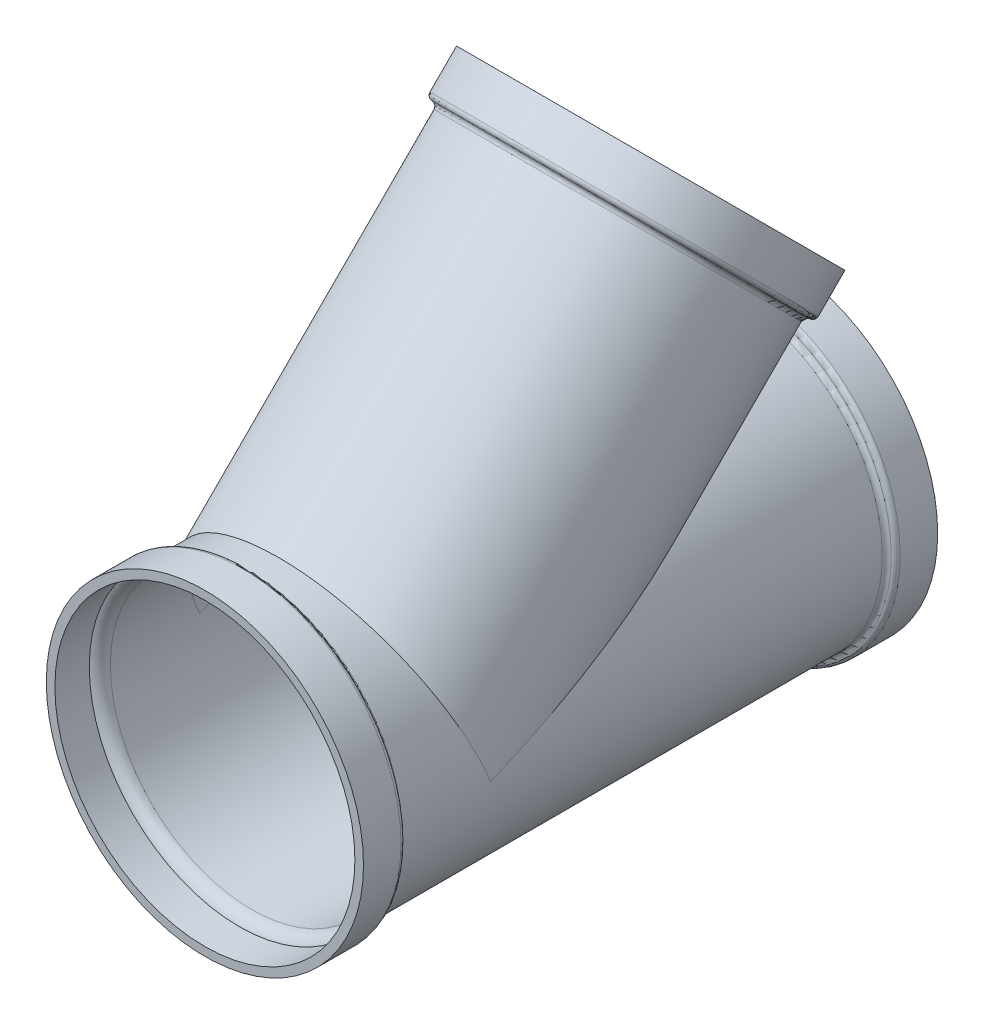
ISO-10303-21;
HEADER;
FILE_DESCRIPTION(('STEP AP214'),'2;1');
FILE_NAME('part.step','',(''),(''),'','','');
FILE_SCHEMA(('AUTOMOTIVE_DESIGN { 1 0 10303 214 1 1 1 1 }'));
ENDSEC;
DATA;
#1=APPLICATION_CONTEXT('core data for automotive mechanical design processes');
#2=APPLICATION_PROTOCOL_DEFINITION('international standard','automotive_design',2000,#1);
#3=PRODUCT_CONTEXT('',#1,'mechanical');
#4=PRODUCT('Part','Part','',(#3));
#5=PRODUCT_RELATED_PRODUCT_CATEGORY('part','',(#4));
#6=PRODUCT_DEFINITION_FORMATION('','',#4);
#7=PRODUCT_DEFINITION_CONTEXT('part definition',#1,'design');
#8=PRODUCT_DEFINITION('design','',#6,#7);
#9=PRODUCT_DEFINITION_SHAPE('','',#8);
#10=(LENGTH_UNIT() NAMED_UNIT(*) SI_UNIT(.MILLI.,.METRE.));
#11=(NAMED_UNIT(*) PLANE_ANGLE_UNIT() SI_UNIT($,.RADIAN.));
#12=(NAMED_UNIT(*) SI_UNIT($,.STERADIAN.) SOLID_ANGLE_UNIT());
#13=UNCERTAINTY_MEASURE_WITH_UNIT(LENGTH_MEASURE(1.E-05),#10,'distance_accuracy_value','');
#14=(GEOMETRIC_REPRESENTATION_CONTEXT(3) GLOBAL_UNCERTAINTY_ASSIGNED_CONTEXT((#13)) GLOBAL_UNIT_ASSIGNED_CONTEXT((#10,
#11,#12)) REPRESENTATION_CONTEXT('',''));
#15=CARTESIAN_POINT('',(0.,0.,0.));
#16=DIRECTION('',(0.,0.,1.));
#17=DIRECTION('',(1.,0.,0.));
#18=AXIS2_PLACEMENT_3D('',#15,#16,#17);
#19=CARTESIAN_POINT('',(0.,0.,307.18125));
#20=DIRECTION('',(0.,-0.707106781186549,0.707106781186546));
#21=DIRECTION('',(0.,-0.707106781186546,-0.707106781186549));
#22=AXIS2_PLACEMENT_3D('',#19,#20,#21);
#23=CYLINDRICAL_SURFACE('',#22,287.3502);
#24=CARTESIAN_POINT('',(0.,562.436147225899,-255.254897225897));
#25=DIRECTION('',(0.,-0.707106781186549,0.707106781186546));
#26=DIRECTION('',(0.,-0.707106781186546,-0.707106781186549));
#27=AXIS2_PLACEMENT_3D('',#24,#25,#26);
#28=CIRCLE('',#27,287.3502);
#29=CARTESIAN_POINT('',(0.,359.248872230589,-458.442172221208));
#30=VERTEX_POINT('',#29);
#31=EDGE_CURVE('E83',#30,#30,#28,.T.);
#32=ORIENTED_EDGE('',*,*,#31,.F.);
#33=EDGE_LOOP('',(#32));
#34=FACE_BOUND('',#33,.T.);
#35=CARTESIAN_POINT('',(0.,0.,307.18125));
#36=DIRECTION('',(0.,-0.923879532511286,-0.382683432365091));
#37=DIRECTION('',(0.,-0.382683432365091,0.923879532511286));
#38=AXIS2_PLACEMENT_3D('',#35,#36,#37);
#39=ELLIPSE('',#38,750.882258539637,287.3502);
#40=CARTESIAN_POINT('',(-287.3502,2.02432871136862E-13,307.18125));
#41=VERTEX_POINT('',#40);
#42=CARTESIAN_POINT('',(287.3502,5.03834287174836E-13,307.18125));
#43=VERTEX_POINT('',#42);
#44=EDGE_CURVE('E75',#41,#43,#39,.T.);
#45=ORIENTED_EDGE('',*,*,#44,.T.);
#46=CARTESIAN_POINT('',(0.,0.,307.18125));
#47=DIRECTION('',(0.,-0.382683432365091,0.923879532511286));
#48=DIRECTION('',(0.,-0.923879532511286,-0.382683432365091));
#49=AXIS2_PLACEMENT_3D('',#46,#47,#48);
#50=ELLIPSE('',#49,311.02561523246,287.3502);
#51=EDGE_CURVE('E61',#43,#41,#50,.T.);
#52=ORIENTED_EDGE('',*,*,#51,.T.);
#53=EDGE_LOOP('',(#45,#52));
#54=FACE_BOUND('',#53,.T.);
#55=ADVANCED_FACE('F43',(#34,#54),#23,.F.);
#56=CARTESIAN_POINT('',(0.,0.,168.70511138535));
#57=DIRECTION('',(0.,0.,1.));
#58=DIRECTION('',(1.,0.,0.));
#59=AXIS2_PLACEMENT_3D('',#56,#57,#58);
#60=CYLINDRICAL_SURFACE('',#59,304.8);
#61=CARTESIAN_POINT('',(0.,0.,-488.223577375735));
#62=DIRECTION('',(0.,0.,1.));
#63=DIRECTION('',(1.,0.,0.));
#64=AXIS2_PLACEMENT_3D('',#61,#62,#63);
#65=CIRCLE('',#64,304.8);
#66=CARTESIAN_POINT('',(304.8,0.,-488.223577375735));
#67=VERTEX_POINT('',#66);
#68=EDGE_CURVE('E131',#67,#67,#65,.T.);
#69=ORIENTED_EDGE('',*,*,#68,.T.);
#70=EDGE_LOOP('',(#69));
#71=FACE_BOUND('',#70,.T.);
#72=CARTESIAN_POINT('',(0.,0.,488.223577375735));
#73=DIRECTION('',(0.,0.,1.));
#74=DIRECTION('',(1.,0.,0.));
#75=AXIS2_PLACEMENT_3D('',#72,#73,#74);
#76=CIRCLE('',#75,304.8);
#77=CARTESIAN_POINT('',(304.8,0.,488.223577375735));
#78=VERTEX_POINT('',#77);
#79=EDGE_CURVE('E127',#78,#78,#76,.T.);
#80=ORIENTED_EDGE('',*,*,#79,.F.);
#81=EDGE_LOOP('',(#80));
#82=FACE_BOUND('',#81,.T.);
#83=CARTESIAN_POINT('',(0.,0.,307.18125));
#84=DIRECTION('',(0.,-0.382683432365091,0.923879532511286));
#85=DIRECTION('',(0.,0.923879532511286,0.382683432365091));
#86=AXIS2_PLACEMENT_3D('',#83,#84,#85);
#87=ELLIPSE('',#86,329.913142649122,304.8);
#88=CARTESIAN_POINT('',(-304.8,0.,307.18125));
#89=VERTEX_POINT('',#88);
#90=CARTESIAN_POINT('',(304.8,0.,307.18125));
#91=VERTEX_POINT('',#90);
#92=EDGE_CURVE('E11',#89,#91,#87,.F.);
#93=ORIENTED_EDGE('',*,*,#92,.F.);
#94=CARTESIAN_POINT('',(0.,0.,307.18125));
#95=DIRECTION('',(0.,0.923879532511286,0.382683432365091));
#96=DIRECTION('',(0.,-0.382683432365091,0.923879532511286));
#97=AXIS2_PLACEMENT_3D('',#94,#95,#96);
#98=ELLIPSE('',#97,796.480783388637,304.8);
#99=EDGE_CURVE('E52',#91,#89,#98,.T.);
#100=ORIENTED_EDGE('',*,*,#99,.F.);
#101=EDGE_LOOP('',(#93,#100));
#102=FACE_BOUND('',#101,.T.);
#103=ADVANCED_FACE('F150',(#71,#82,#102),#60,.T.);
#104=CARTESIAN_POINT('',(0.,-1.38519034047308E-13,583.40625));
#105=DIRECTION('',(0.,0.,-1.));
#106=DIRECTION('',(-1.,0.,0.));
#107=AXIS2_PLACEMENT_3D('',#104,#105,#106);
#108=PLANE('',#107);
#109=CARTESIAN_POINT('',(0.,0.,583.40625));
#110=DIRECTION('',(0.,0.,1.));
#111=DIRECTION('',(1.,0.,0.));
#112=AXIS2_PLACEMENT_3D('',#109,#110,#111);
#113=CIRCLE('',#112,304.8);
#114=CARTESIAN_POINT('',(304.8,0.,583.40625));
#115=VERTEX_POINT('',#114);
#116=EDGE_CURVE('E190',#115,#115,#113,.T.);
#117=ORIENTED_EDGE('',*,*,#116,.F.);
#118=EDGE_LOOP('',(#117));
#119=FACE_BOUND('',#118,.T.);
#120=CARTESIAN_POINT('',(0.,0.,583.40625));
#121=DIRECTION('',(0.,0.,1.));
#122=DIRECTION('',(1.,0.,0.));
#123=AXIS2_PLACEMENT_3D('',#120,#121,#122);
#124=CIRCLE('',#123,322.2498);
#125=CARTESIAN_POINT('',(322.2498,0.,583.40625));
#126=VERTEX_POINT('',#125);
#127=EDGE_CURVE('E115',#126,#126,#124,.T.);
#128=ORIENTED_EDGE('',*,*,#127,.T.);
#129=EDGE_LOOP('',(#128));
#130=FACE_BOUND('',#129,.T.);
#131=ADVANCED_FACE('F45',(#119,#130),#108,.F.);
#132=CARTESIAN_POINT('',(0.,322.2498,-583.40625));
#133=DIRECTION('',(0.,0.,1.));
#134=DIRECTION('',(1.,0.,0.));
#135=AXIS2_PLACEMENT_3D('',#132,#133,#134);
#136=PLANE('',#135);
#137=CARTESIAN_POINT('',(0.,0.,-583.40625));
#138=DIRECTION('',(0.,0.,1.));
#139=DIRECTION('',(1.,0.,0.));
#140=AXIS2_PLACEMENT_3D('',#137,#138,#139);
#141=CIRCLE('',#140,304.8);
#142=CARTESIAN_POINT('',(304.8,0.,-583.40625));
#143=VERTEX_POINT('',#142);
#144=EDGE_CURVE('E185',#143,#143,#141,.T.);
#145=ORIENTED_EDGE('',*,*,#144,.T.);
#146=EDGE_LOOP('',(#145));
#147=FACE_BOUND('',#146,.T.);
#148=CARTESIAN_POINT('',(0.,0.,-583.40625));
#149=DIRECTION('',(0.,0.,1.));
#150=DIRECTION('',(1.,0.,0.));
#151=AXIS2_PLACEMENT_3D('',#148,#149,#150);
#152=CIRCLE('',#151,322.2498);
#153=CARTESIAN_POINT('',(322.2498,0.,-583.40625));
#154=VERTEX_POINT('',#153);
#155=EDGE_CURVE('E143',#154,#154,#152,.T.);
#156=ORIENTED_EDGE('',*,*,#155,.F.);
#157=EDGE_LOOP('',(#156));
#158=FACE_BOUND('',#157,.T.);
#159=ADVANCED_FACE('F158',(#147,#158),#136,.F.);
#160=CARTESIAN_POINT('',(0.,0.,168.70511138535));
#161=DIRECTION('',(0.,0.,1.));
#162=DIRECTION('',(1.,0.,0.));
#163=AXIS2_PLACEMENT_3D('',#160,#161,#162);
#164=CYLINDRICAL_SURFACE('',#163,322.2498);
#165=CARTESIAN_POINT('',(0.,0.,-507.20625));
#166=DIRECTION('',(0.,0.,1.));
#167=DIRECTION('',(1.,0.,0.));
#168=AXIS2_PLACEMENT_3D('',#165,#166,#167);
#169=CIRCLE('',#168,322.2498);
#170=CARTESIAN_POINT('',(322.2498,0.,-507.20625));
#171=VERTEX_POINT('',#170);
#172=EDGE_CURVE('E139',#171,#171,#169,.T.);
#173=ORIENTED_EDGE('',*,*,#172,.F.);
#174=EDGE_LOOP('',(#173));
#175=FACE_BOUND('',#174,.T.);
#176=ORIENTED_EDGE('',*,*,#155,.T.);
#177=EDGE_LOOP('',(#176));
#178=FACE_BOUND('',#177,.T.);
#179=ADVANCED_FACE('F174',(#175,#178),#164,.T.);
#180=CARTESIAN_POINT('',(0.,0.,-507.20625));
#181=DIRECTION('',(0.,0.,1.));
#182=DIRECTION('',(1.,0.,0.));
#183=AXIS2_PLACEMENT_3D('',#180,#181,#182);
#184=TOROIDAL_SURFACE('',#183,312.7248,9.52500000000002);
#185=CARTESIAN_POINT('',(0.,0.,-497.714913687868));
#186=DIRECTION('',(0.,0.,1.));
#187=DIRECTION('',(1.,0.,0.));
#188=AXIS2_PLACEMENT_3D('',#185,#186,#187);
#189=CIRCLE('',#188,313.5249);
#190=CARTESIAN_POINT('',(313.5249,0.,-497.714913687868));
#191=VERTEX_POINT('',#190);
#192=EDGE_CURVE('E135',#191,#191,#189,.T.);
#193=ORIENTED_EDGE('',*,*,#192,.F.);
#194=EDGE_LOOP('',(#193));
#195=FACE_BOUND('',#194,.T.);
#196=ORIENTED_EDGE('',*,*,#172,.T.);
#197=EDGE_LOOP('',(#196));
#198=FACE_BOUND('',#197,.T.);
#199=ADVANCED_FACE('F170',(#195,#198),#184,.T.);
#200=CARTESIAN_POINT('',(0.,0.,-488.223577375735));
#201=DIRECTION('',(0.,0.,1.));
#202=DIRECTION('',(1.,0.,0.));
#203=AXIS2_PLACEMENT_3D('',#200,#201,#202);
#204=TOROIDAL_SURFACE('',#203,314.325,9.52499999999997);
#205=ORIENTED_EDGE('',*,*,#68,.F.);
#206=EDGE_LOOP('',(#205));
#207=FACE_BOUND('',#206,.T.);
#208=ORIENTED_EDGE('',*,*,#192,.T.);
#209=EDGE_LOOP('',(#208));
#210=FACE_BOUND('',#209,.T.);
#211=ADVANCED_FACE('F167',(#207,#210),#204,.F.);
#212=CARTESIAN_POINT('',(0.,0.,488.223577375735));
#213=DIRECTION('',(0.,0.,1.));
#214=DIRECTION('',(1.,0.,0.));
#215=AXIS2_PLACEMENT_3D('',#212,#213,#214);
#216=TOROIDAL_SURFACE('',#215,314.325,9.52499999999997);
#217=CARTESIAN_POINT('',(0.,0.,497.714913687868));
#218=DIRECTION('',(0.,0.,1.));
#219=DIRECTION('',(1.,0.,0.));
#220=AXIS2_PLACEMENT_3D('',#217,#218,#219);
#221=CIRCLE('',#220,313.5249);
#222=CARTESIAN_POINT('',(313.5249,0.,497.714913687868));
#223=VERTEX_POINT('',#222);
#224=EDGE_CURVE('E123',#223,#223,#221,.T.);
#225=ORIENTED_EDGE('',*,*,#224,.F.);
#226=EDGE_LOOP('',(#225));
#227=FACE_BOUND('',#226,.T.);
#228=ORIENTED_EDGE('',*,*,#79,.T.);
#229=EDGE_LOOP('',(#228));
#230=FACE_BOUND('',#229,.T.);
#231=ADVANCED_FACE('F165',(#227,#230),#216,.F.);
#232=CARTESIAN_POINT('',(0.,0.,507.20625));
#233=DIRECTION('',(0.,0.,1.));
#234=DIRECTION('',(1.,0.,0.));
#235=AXIS2_PLACEMENT_3D('',#232,#233,#234);
#236=TOROIDAL_SURFACE('',#235,312.7248,9.52500000000002);
#237=CARTESIAN_POINT('',(0.,0.,507.20625));
#238=DIRECTION('',(0.,0.,1.));
#239=DIRECTION('',(1.,0.,0.));
#240=AXIS2_PLACEMENT_3D('',#237,#238,#239);
#241=CIRCLE('',#240,322.2498);
#242=CARTESIAN_POINT('',(322.2498,0.,507.20625));
#243=VERTEX_POINT('',#242);
#244=EDGE_CURVE('E119',#243,#243,#241,.T.);
#245=ORIENTED_EDGE('',*,*,#244,.F.);
#246=EDGE_LOOP('',(#245));
#247=FACE_BOUND('',#246,.T.);
#248=ORIENTED_EDGE('',*,*,#224,.T.);
#249=EDGE_LOOP('',(#248));
#250=FACE_BOUND('',#249,.T.);
#251=ADVANCED_FACE('F258',(#247,#250),#236,.T.);
#252=CARTESIAN_POINT('',(0.,0.,168.70511138535));
#253=DIRECTION('',(0.,0.,1.));
#254=DIRECTION('',(1.,0.,0.));
#255=AXIS2_PLACEMENT_3D('',#252,#253,#254);
#256=CYLINDRICAL_SURFACE('',#255,322.2498);
#257=ORIENTED_EDGE('',*,*,#127,.F.);
#258=EDGE_LOOP('',(#257));
#259=FACE_BOUND('',#258,.T.);
#260=ORIENTED_EDGE('',*,*,#244,.T.);
#261=EDGE_LOOP('',(#260));
#262=FACE_BOUND('',#261,.T.);
#263=ADVANCED_FACE('F241',(#259,#262),#256,.T.);
#264=CARTESIAN_POINT('',(0.,0.,307.18125));
#265=DIRECTION('',(0.,-0.707106781186549,0.707106781186546));
#266=DIRECTION('',(0.,-0.707106781186546,-0.707106781186549));
#267=AXIS2_PLACEMENT_3D('',#264,#265,#266);
#268=CYLINDRICAL_SURFACE('',#267,304.8);
#269=CARTESIAN_POINT('',(0.,562.436147225899,-255.254897225897));
#270=DIRECTION('',(0.,-0.707106781186549,0.707106781186546));
#271=DIRECTION('',(0.,-0.707106781186546,-0.707106781186549));
#272=AXIS2_PLACEMENT_3D('',#269,#270,#271);
#273=CIRCLE('',#272,304.8);
#274=CARTESIAN_POINT('',(0.,346.91000032024,-470.781044131557));
#275=VERTEX_POINT('',#274);
#276=EDGE_CURVE('E99',#275,#275,#273,.T.);
#277=ORIENTED_EDGE('',*,*,#276,.T.);
#278=EDGE_LOOP('',(#277));
#279=FACE_BOUND('',#278,.T.);
#280=ORIENTED_EDGE('',*,*,#99,.T.);
#281=ORIENTED_EDGE('',*,*,#92,.T.);
#282=EDGE_LOOP('',(#280,#281));
#283=FACE_BOUND('',#282,.T.);
#284=ADVANCED_FACE('F149',(#279,#283),#268,.T.);
#285=CARTESIAN_POINT('',(0.,857.605479305984,-94.6941916739641));
#286=DIRECTION('',(0.,-0.707106781186549,0.707106781186546));
#287=DIRECTION('',(0.,-0.707106781186546,-0.707106781186549));
#288=AXIS2_PLACEMENT_3D('',#285,#286,#287);
#289=PLANE('',#288);
#290=CARTESIAN_POINT('',(0.,629.740460489977,-322.559210489974));
#291=DIRECTION('',(0.,-0.707106781186549,0.707106781186546));
#292=DIRECTION('',(0.,-0.707106781186546,-0.707106781186549));
#293=AXIS2_PLACEMENT_3D('',#290,#291,#292);
#294=CIRCLE('',#293,304.8);
#295=CARTESIAN_POINT('',(0.,414.214313584318,-538.085357395634));
#296=VERTEX_POINT('',#295);
#297=EDGE_CURVE('E95',#296,#296,#294,.T.);
#298=ORIENTED_EDGE('',*,*,#297,.T.);
#299=EDGE_LOOP('',(#298));
#300=FACE_BOUND('',#299,.T.);
#301=CARTESIAN_POINT('',(0.,629.740460489976,-322.559210489973));
#302=DIRECTION('',(0.,-0.707106781186549,0.707106781186546));
#303=DIRECTION('',(0.,-0.707106781186546,-0.707106781186549));
#304=AXIS2_PLACEMENT_3D('',#301,#302,#303);
#305=CIRCLE('',#304,322.2498);
#306=CARTESIAN_POINT('',(0.,401.875441673968,-550.424229305982));
#307=VERTEX_POINT('',#306);
#308=EDGE_CURVE('E111',#307,#307,#305,.T.);
#309=ORIENTED_EDGE('',*,*,#308,.F.);
#310=EDGE_LOOP('',(#309));
#311=FACE_BOUND('',#310,.T.);
#312=ADVANCED_FACE('F240',(#300,#311),#289,.F.);
#313=CARTESIAN_POINT('',(0.,0.,307.18125));
#314=DIRECTION('',(0.,-0.707106781186549,0.707106781186546));
#315=DIRECTION('',(0.,-0.707106781186546,-0.707106781186549));
#316=AXIS2_PLACEMENT_3D('',#313,#314,#315);
#317=CYLINDRICAL_SURFACE('',#316,322.2498);
#318=CARTESIAN_POINT('',(0.,575.858923763561,-268.677673763558));
#319=DIRECTION('',(0.,-0.707106781186549,0.707106781186546));
#320=DIRECTION('',(0.,-0.707106781186546,-0.707106781186549));
#321=AXIS2_PLACEMENT_3D('',#318,#319,#320);
#322=CIRCLE('',#321,322.2498);
#323=CARTESIAN_POINT('',(0.,347.993904947553,-496.542692579567));
#324=VERTEX_POINT('',#323);
#325=EDGE_CURVE('E107',#324,#324,#322,.T.);
#326=ORIENTED_EDGE('',*,*,#325,.F.);
#327=EDGE_LOOP('',(#326));
#328=FACE_BOUND('',#327,.T.);
#329=ORIENTED_EDGE('',*,*,#308,.T.);
#330=EDGE_LOOP('',(#329));
#331=FACE_BOUND('',#330,.T.);
#332=ADVANCED_FACE('F249',(#328,#331),#317,.T.);
#333=CARTESIAN_POINT('',(0.,575.858923763561,-268.677673763558));
#334=DIRECTION('',(0.,-0.707106781186549,0.707106781186546));
#335=DIRECTION('',(0.,-0.707106781186546,-0.707106781186549));
#336=AXIS2_PLACEMENT_3D('',#333,#334,#335);
#337=TOROIDAL_SURFACE('',#336,312.7248,9.52500000000002);
#338=CARTESIAN_POINT('',(0.,569.14753549473,-261.966285494728));
#339=DIRECTION('',(0.,-0.707106781186549,0.707106781186546));
#340=DIRECTION('',(0.,-0.707106781186546,-0.707106781186549));
#341=AXIS2_PLACEMENT_3D('',#338,#339,#340);
#342=CIRCLE('',#341,313.5249);
#343=CARTESIAN_POINT('',(0.,347.451952633897,-483.661868355562));
#344=VERTEX_POINT('',#343);
#345=EDGE_CURVE('E103',#344,#344,#342,.T.);
#346=ORIENTED_EDGE('',*,*,#345,.F.);
#347=EDGE_LOOP('',(#346));
#348=FACE_BOUND('',#347,.T.);
#349=ORIENTED_EDGE('',*,*,#325,.T.);
#350=EDGE_LOOP('',(#349));
#351=FACE_BOUND('',#350,.T.);
#352=ADVANCED_FACE('F245',(#348,#351),#337,.T.);
#353=CARTESIAN_POINT('',(0.,562.436147225899,-255.254897225897));
#354=DIRECTION('',(0.,-0.707106781186549,0.707106781186546));
#355=DIRECTION('',(0.,-0.707106781186546,-0.707106781186549));
#356=AXIS2_PLACEMENT_3D('',#353,#354,#355);
#357=TOROIDAL_SURFACE('',#356,314.325,9.52499999999998);
#358=ORIENTED_EDGE('',*,*,#276,.F.);
#359=EDGE_LOOP('',(#358));
#360=FACE_BOUND('',#359,.T.);
#361=ORIENTED_EDGE('',*,*,#345,.T.);
#362=EDGE_LOOP('',(#361));
#363=FACE_BOUND('',#362,.T.);
#364=ADVANCED_FACE('F236',(#360,#363),#357,.F.);
#365=CARTESIAN_POINT('',(0.,0.,307.18125));
#366=DIRECTION('',(0.,-0.707106781186549,0.707106781186546));
#367=DIRECTION('',(0.,-0.707106781186546,-0.707106781186549));
#368=AXIS2_PLACEMENT_3D('',#365,#366,#367);
#369=CYLINDRICAL_SURFACE('',#368,304.8);
#370=CARTESIAN_POINT('',(0.,580.281513711909,-273.100263711906));
#371=DIRECTION('',(0.,-0.707106781186549,0.707106781186546));
#372=DIRECTION('',(0.,-0.707106781186546,-0.707106781186549));
#373=AXIS2_PLACEMENT_3D('',#370,#371,#372);
#374=CIRCLE('',#373,304.8);
#375=CARTESIAN_POINT('',(0.,364.75536680625,-488.626410617566));
#376=VERTEX_POINT('',#375);
#377=EDGE_CURVE('E88',#376,#376,#374,.T.);
#378=ORIENTED_EDGE('',*,*,#377,.T.);
#379=EDGE_LOOP('',(#378));
#380=FACE_BOUND('',#379,.T.);
#381=ORIENTED_EDGE('',*,*,#297,.F.);
#382=EDGE_LOOP('',(#381));
#383=FACE_BOUND('',#382,.T.);
#384=ADVANCED_FACE('F232',(#380,#383),#369,.F.);
#385=CARTESIAN_POINT('',(0.,562.436147225899,-255.254897225897));
#386=DIRECTION('',(0.,-0.707106781186549,0.707106781186546));
#387=DIRECTION('',(0.,-0.707106781186546,-0.707106781186549));
#388=AXIS2_PLACEMENT_3D('',#385,#386,#387);
#389=TOROIDAL_SURFACE('',#388,314.325,26.9748);
#390=ORIENTED_EDGE('',*,*,#31,.T.);
#391=EDGE_LOOP('',(#390));
#392=FACE_BOUND('',#391,.T.);
#393=ORIENTED_EDGE('',*,*,#377,.F.);
#394=EDGE_LOOP('',(#393));
#395=FACE_BOUND('',#394,.T.);
#396=ADVANCED_FACE('F226',(#392,#395),#389,.T.);
#397=CARTESIAN_POINT('',(0.,0.,-488.223577375735));
#398=DIRECTION('',(0.,0.,1.));
#399=DIRECTION('',(1.,0.,0.));
#400=AXIS2_PLACEMENT_3D('',#397,#398,#399);
#401=TOROIDAL_SURFACE('',#400,314.325,26.9748);
#402=CARTESIAN_POINT('',(0.,0.,-488.223577375735));
#403=DIRECTION('',(0.,0.,1.));
#404=DIRECTION('',(1.,0.,0.));
#405=AXIS2_PLACEMENT_3D('',#402,#403,#404);
#406=CIRCLE('',#405,287.3502);
#407=CARTESIAN_POINT('',(287.3502,0.,-488.223577375735));
#408=VERTEX_POINT('',#407);
#409=EDGE_CURVE('E80',#408,#408,#406,.T.);
#410=ORIENTED_EDGE('',*,*,#409,.T.);
#411=EDGE_LOOP('',(#410));
#412=FACE_BOUND('',#411,.T.);
#413=CARTESIAN_POINT('',(0.,0.,-513.460736685769));
#414=DIRECTION('',(0.,0.,1.));
#415=DIRECTION('',(1.,0.,0.));
#416=AXIS2_PLACEMENT_3D('',#413,#414,#415);
#417=CIRCLE('',#416,304.8);
#418=CARTESIAN_POINT('',(304.8,0.,-513.460736685769));
#419=VERTEX_POINT('',#418);
#420=EDGE_CURVE('E191',#419,#419,#417,.T.);
#421=ORIENTED_EDGE('',*,*,#420,.F.);
#422=EDGE_LOOP('',(#421));
#423=FACE_BOUND('',#422,.T.);
#424=ADVANCED_FACE('F213',(#412,#423),#401,.T.);
#425=CARTESIAN_POINT('',(0.,0.,168.70511138535));
#426=DIRECTION('',(0.,0.,1.));
#427=DIRECTION('',(1.,0.,0.));
#428=AXIS2_PLACEMENT_3D('',#425,#426,#427);
#429=CYLINDRICAL_SURFACE('',#428,287.3502);
#430=ORIENTED_EDGE('',*,*,#44,.F.);
#431=ORIENTED_EDGE('',*,*,#51,.F.);
#432=EDGE_LOOP('',(#430,#431));
#433=FACE_BOUND('',#432,.T.);
#434=CARTESIAN_POINT('',(0.,0.,488.223577375735));
#435=DIRECTION('',(0.,0.,1.));
#436=DIRECTION('',(1.,0.,0.));
#437=AXIS2_PLACEMENT_3D('',#434,#435,#436);
#438=CIRCLE('',#437,287.3502);
#439=CARTESIAN_POINT('',(287.3502,0.,488.223577375735));
#440=VERTEX_POINT('',#439);
#441=EDGE_CURVE('E205',#440,#440,#438,.T.);
#442=ORIENTED_EDGE('',*,*,#441,.T.);
#443=EDGE_LOOP('',(#442));
#444=FACE_BOUND('',#443,.T.);
#445=ORIENTED_EDGE('',*,*,#409,.F.);
#446=EDGE_LOOP('',(#445));
#447=FACE_BOUND('',#446,.T.);
#448=ADVANCED_FACE('F76',(#433,#444,#447),#429,.F.);
#449=CARTESIAN_POINT('',(0.,0.,488.223577375735));
#450=DIRECTION('',(0.,0.,1.));
#451=DIRECTION('',(1.,0.,0.));
#452=AXIS2_PLACEMENT_3D('',#449,#450,#451);
#453=TOROIDAL_SURFACE('',#452,314.325,26.9748);
#454=CARTESIAN_POINT('',(0.,0.,513.460736685769));
#455=DIRECTION('',(0.,0.,1.));
#456=DIRECTION('',(1.,0.,0.));
#457=AXIS2_PLACEMENT_3D('',#454,#455,#456);
#458=CIRCLE('',#457,304.8);
#459=CARTESIAN_POINT('',(304.8,0.,513.460736685769));
#460=VERTEX_POINT('',#459);
#461=EDGE_CURVE('E197',#460,#460,#458,.T.);
#462=ORIENTED_EDGE('',*,*,#461,.T.);
#463=EDGE_LOOP('',(#462));
#464=FACE_BOUND('',#463,.T.);
#465=ORIENTED_EDGE('',*,*,#441,.F.);
#466=EDGE_LOOP('',(#465));
#467=FACE_BOUND('',#466,.T.);
#468=ADVANCED_FACE('F217',(#464,#467),#453,.T.);
#469=CARTESIAN_POINT('',(0.,0.,168.70511138535));
#470=DIRECTION('',(0.,0.,1.));
#471=DIRECTION('',(1.,0.,0.));
#472=AXIS2_PLACEMENT_3D('',#469,#470,#471);
#473=CYLINDRICAL_SURFACE('',#472,304.8);
#474=ORIENTED_EDGE('',*,*,#116,.T.);
#475=EDGE_LOOP('',(#474));
#476=FACE_BOUND('',#475,.T.);
#477=ORIENTED_EDGE('',*,*,#461,.F.);
#478=EDGE_LOOP('',(#477));
#479=FACE_BOUND('',#478,.T.);
#480=ADVANCED_FACE('F223',(#476,#479),#473,.F.);
#481=CARTESIAN_POINT('',(0.,0.,168.70511138535));
#482=DIRECTION('',(0.,0.,1.));
#483=DIRECTION('',(1.,0.,0.));
#484=AXIS2_PLACEMENT_3D('',#481,#482,#483);
#485=CYLINDRICAL_SURFACE('',#484,304.8);
#486=ORIENTED_EDGE('',*,*,#420,.T.);
#487=EDGE_LOOP('',(#486));
#488=FACE_BOUND('',#487,.T.);
#489=ORIENTED_EDGE('',*,*,#144,.F.);
#490=EDGE_LOOP('',(#489));
#491=FACE_BOUND('',#490,.T.);
#492=ADVANCED_FACE('F423',(#488,#491),#485,.F.);
#493=CLOSED_SHELL('',(#55,#103,#131,#159,#179,#199,#211,#231,#251,#263,#284,#312,#332,#352,#364,
#384,#396,#424,#448,#468,#480,#492));
#494=MANIFOLD_SOLID_BREP('B2',#493);
#495=ADVANCED_BREP_SHAPE_REPRESENTATION('',(#18,#494),#14);
#496=SHAPE_DEFINITION_REPRESENTATION(#9,#495);
ENDSEC;
END-ISO-10303-21;
